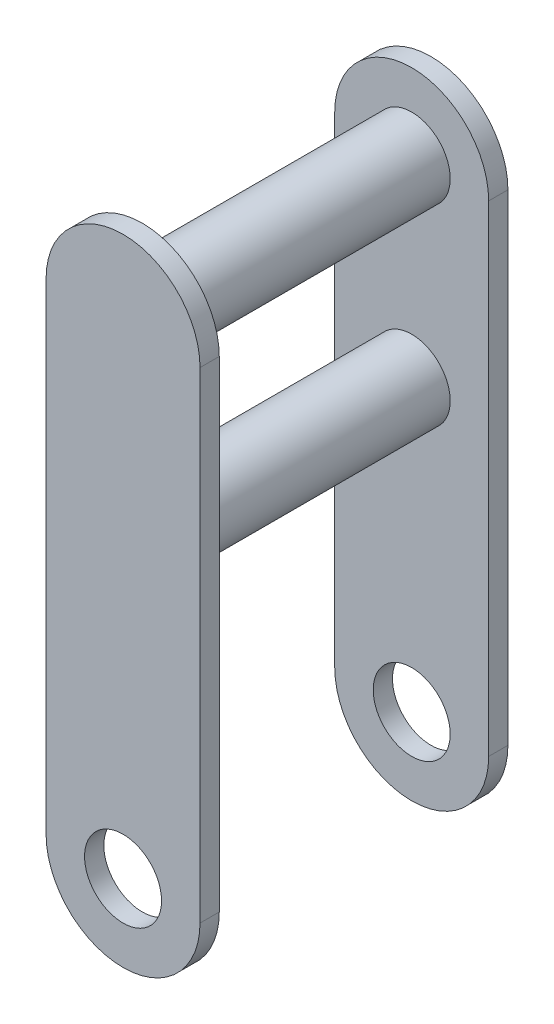
ISO-10303-21;
HEADER;
FILE_DESCRIPTION(('STEP AP214'),'2;1');
FILE_NAME('part.step','',(''),(''),'','','');
FILE_SCHEMA(('AUTOMOTIVE_DESIGN { 1 0 10303 214 1 1 1 1 }'));
ENDSEC;
DATA;
#1=APPLICATION_CONTEXT('core data for automotive mechanical design processes');
#2=APPLICATION_PROTOCOL_DEFINITION('international standard','automotive_design',2000,#1);
#3=PRODUCT_CONTEXT('',#1,'mechanical');
#4=PRODUCT('Part','Part','',(#3));
#5=PRODUCT_RELATED_PRODUCT_CATEGORY('part','',(#4));
#6=PRODUCT_DEFINITION_FORMATION('','',#4);
#7=PRODUCT_DEFINITION_CONTEXT('part definition',#1,'design');
#8=PRODUCT_DEFINITION('design','',#6,#7);
#9=PRODUCT_DEFINITION_SHAPE('','',#8);
#10=(LENGTH_UNIT() NAMED_UNIT(*) SI_UNIT(.MILLI.,.METRE.));
#11=(NAMED_UNIT(*) PLANE_ANGLE_UNIT() SI_UNIT($,.RADIAN.));
#12=(NAMED_UNIT(*) SI_UNIT($,.STERADIAN.) SOLID_ANGLE_UNIT());
#13=UNCERTAINTY_MEASURE_WITH_UNIT(LENGTH_MEASURE(1.E-05),#10,'distance_accuracy_value','');
#14=(GEOMETRIC_REPRESENTATION_CONTEXT(3) GLOBAL_UNCERTAINTY_ASSIGNED_CONTEXT((#13)) GLOBAL_UNIT_ASSIGNED_CONTEXT((#10,
#11,#12)) REPRESENTATION_CONTEXT('',''));
#15=CARTESIAN_POINT('',(0.,0.,0.));
#16=DIRECTION('',(0.,0.,1.));
#17=DIRECTION('',(1.,0.,0.));
#18=AXIS2_PLACEMENT_3D('',#15,#16,#17);
#19=CARTESIAN_POINT('',(0.,0.,80.));
#20=DIRECTION('',(0.,0.,1.));
#21=DIRECTION('',(1.,0.,0.));
#22=AXIS2_PLACEMENT_3D('',#19,#20,#21);
#23=PLANE('',#22);
#24=CARTESIAN_POINT('',(0.,0.,80.));
#25=DIRECTION('',(0.,0.,1.));
#26=DIRECTION('',(1.,0.,0.));
#27=AXIS2_PLACEMENT_3D('',#24,#25,#26);
#28=CIRCLE('',#27,40.);
#29=CARTESIAN_POINT('',(-40.,0.,80.));
#30=VERTEX_POINT('',#29);
#31=CARTESIAN_POINT('',(40.,0.,80.));
#32=VERTEX_POINT('',#31);
#33=EDGE_CURVE('E193',#30,#32,#28,.T.);
#34=ORIENTED_EDGE('',*,*,#33,.T.);
#35=DIRECTION('',(0.,1.,0.));
#36=VECTOR('',#35,1.);
#37=CARTESIAN_POINT('',(40.,0.,80.));
#38=LINE('',#37,#36);
#39=CARTESIAN_POINT('',(40.,250.,80.));
#40=VERTEX_POINT('',#39);
#41=EDGE_CURVE('E93',#32,#40,#38,.T.);
#42=ORIENTED_EDGE('',*,*,#41,.T.);
#43=CARTESIAN_POINT('',(0.,250.,80.));
#44=DIRECTION('',(0.,0.,1.));
#45=DIRECTION('',(1.,0.,0.));
#46=AXIS2_PLACEMENT_3D('',#43,#44,#45);
#47=CIRCLE('',#46,40.);
#48=CARTESIAN_POINT('',(-40.,250.,80.));
#49=VERTEX_POINT('',#48);
#50=EDGE_CURVE('E198',#40,#49,#47,.T.);
#51=ORIENTED_EDGE('',*,*,#50,.T.);
#52=DIRECTION('',(0.,-1.,0.));
#53=VECTOR('',#52,1.);
#54=CARTESIAN_POINT('',(-40.,0.,80.));
#55=LINE('',#54,#53);
#56=EDGE_CURVE('E61',#49,#30,#55,.T.);
#57=ORIENTED_EDGE('',*,*,#56,.T.);
#58=EDGE_LOOP('',(#34,#42,#51,#57));
#59=FACE_BOUND('',#58,.T.);
#60=CARTESIAN_POINT('',(0.,0.,80.));
#61=DIRECTION('',(0.,0.,1.));
#62=DIRECTION('',(1.,0.,0.));
#63=AXIS2_PLACEMENT_3D('',#60,#61,#62);
#64=CIRCLE('',#63,20.);
#65=CARTESIAN_POINT('',(20.,0.,80.));
#66=VERTEX_POINT('',#65);
#67=EDGE_CURVE('E185',#66,#66,#64,.T.);
#68=ORIENTED_EDGE('',*,*,#67,.F.);
#69=EDGE_LOOP('',(#68));
#70=FACE_BOUND('',#69,.T.);
#71=ADVANCED_FACE('F43',(#59,#70),#23,.T.);
#72=CARTESIAN_POINT('',(0.,0.,70.));
#73=DIRECTION('',(0.,0.,1.));
#74=DIRECTION('',(1.,0.,0.));
#75=AXIS2_PLACEMENT_3D('',#72,#73,#74);
#76=PLANE('',#75);
#77=CARTESIAN_POINT('',(0.,150.,70.));
#78=DIRECTION('',(0.,0.,1.));
#79=DIRECTION('',(1.,0.,0.));
#80=AXIS2_PLACEMENT_3D('',#77,#78,#79);
#81=CIRCLE('',#80,20.);
#82=CARTESIAN_POINT('',(20.,150.,70.));
#83=VERTEX_POINT('',#82);
#84=EDGE_CURVE('E11',#83,#83,#81,.F.);
#85=ORIENTED_EDGE('',*,*,#84,.F.);
#86=EDGE_LOOP('',(#85));
#87=FACE_BOUND('',#86,.T.);
#88=CARTESIAN_POINT('',(0.,250.,70.));
#89=DIRECTION('',(0.,0.,1.));
#90=DIRECTION('',(1.,0.,0.));
#91=AXIS2_PLACEMENT_3D('',#88,#89,#90);
#92=CIRCLE('',#91,20.);
#93=CARTESIAN_POINT('',(20.,250.,70.));
#94=VERTEX_POINT('',#93);
#95=EDGE_CURVE('E53',#94,#94,#92,.F.);
#96=ORIENTED_EDGE('',*,*,#95,.F.);
#97=EDGE_LOOP('',(#96));
#98=FACE_BOUND('',#97,.T.);
#99=CARTESIAN_POINT('',(0.,0.,70.));
#100=DIRECTION('',(0.,0.,1.));
#101=DIRECTION('',(1.,0.,0.));
#102=AXIS2_PLACEMENT_3D('',#99,#100,#101);
#103=CIRCLE('',#102,40.);
#104=CARTESIAN_POINT('',(-40.,0.,70.));
#105=VERTEX_POINT('',#104);
#106=CARTESIAN_POINT('',(40.,0.,70.));
#107=VERTEX_POINT('',#106);
#108=EDGE_CURVE('E189',#105,#107,#103,.T.);
#109=ORIENTED_EDGE('',*,*,#108,.F.);
#110=DIRECTION('',(0.,-1.,0.));
#111=VECTOR('',#110,1.);
#112=CARTESIAN_POINT('',(-40.,0.,70.));
#113=LINE('',#112,#111);
#114=CARTESIAN_POINT('',(-40.,250.,70.));
#115=VERTEX_POINT('',#114);
#116=EDGE_CURVE('E85',#115,#105,#113,.T.);
#117=ORIENTED_EDGE('',*,*,#116,.F.);
#118=CARTESIAN_POINT('',(0.,250.,70.));
#119=DIRECTION('',(0.,0.,1.));
#120=DIRECTION('',(1.,0.,0.));
#121=AXIS2_PLACEMENT_3D('',#118,#119,#120);
#122=CIRCLE('',#121,40.);
#123=CARTESIAN_POINT('',(40.,250.,70.));
#124=VERTEX_POINT('',#123);
#125=EDGE_CURVE('E79',#124,#115,#122,.T.);
#126=ORIENTED_EDGE('',*,*,#125,.F.);
#127=DIRECTION('',(0.,1.,0.));
#128=VECTOR('',#127,1.);
#129=CARTESIAN_POINT('',(40.,0.,70.));
#130=LINE('',#129,#128);
#131=EDGE_CURVE('E207',#107,#124,#130,.T.);
#132=ORIENTED_EDGE('',*,*,#131,.F.);
#133=EDGE_LOOP('',(#109,#117,#126,#132));
#134=FACE_BOUND('',#133,.T.);
#135=CARTESIAN_POINT('',(0.,0.,70.));
#136=DIRECTION('',(0.,0.,1.));
#137=DIRECTION('',(1.,0.,0.));
#138=AXIS2_PLACEMENT_3D('',#135,#136,#137);
#139=CIRCLE('',#138,20.);
#140=CARTESIAN_POINT('',(20.,0.,70.));
#141=VERTEX_POINT('',#140);
#142=EDGE_CURVE('E184',#141,#141,#139,.T.);
#143=ORIENTED_EDGE('',*,*,#142,.T.);
#144=EDGE_LOOP('',(#143));
#145=FACE_BOUND('',#144,.T.);
#146=ADVANCED_FACE('F230',(#87,#98,#134,#145),#76,.F.);
#147=CARTESIAN_POINT('',(0.,0.,80.));
#148=DIRECTION('',(0.,0.,-1.));
#149=DIRECTION('',(-1.,0.,0.));
#150=AXIS2_PLACEMENT_3D('',#147,#148,#149);
#151=CYLINDRICAL_SURFACE('',#150,40.);
#152=ORIENTED_EDGE('',*,*,#108,.T.);
#153=DIRECTION('',(0.,0.,-1.));
#154=VECTOR('',#153,1.);
#155=CARTESIAN_POINT('',(40.,0.,80.));
#156=LINE('',#155,#154);
#157=EDGE_CURVE('E222',#32,#107,#156,.T.);
#158=ORIENTED_EDGE('',*,*,#157,.F.);
#159=ORIENTED_EDGE('',*,*,#33,.F.);
#160=DIRECTION('',(0.,0.,-1.));
#161=VECTOR('',#160,1.);
#162=CARTESIAN_POINT('',(-40.,0.,80.));
#163=LINE('',#162,#161);
#164=EDGE_CURVE('E203',#30,#105,#163,.T.);
#165=ORIENTED_EDGE('',*,*,#164,.T.);
#166=EDGE_LOOP('',(#152,#158,#159,#165));
#167=FACE_BOUND('',#166,.T.);
#168=ADVANCED_FACE('F45',(#167),#151,.T.);
#169=CARTESIAN_POINT('',(40.,0.,80.));
#170=DIRECTION('',(-1.,0.,0.));
#171=DIRECTION('',(0.,0.,1.));
#172=AXIS2_PLACEMENT_3D('',#169,#170,#171);
#173=PLANE('',#172);
#174=ORIENTED_EDGE('',*,*,#131,.T.);
#175=DIRECTION('',(0.,0.,-1.));
#176=VECTOR('',#175,1.);
#177=CARTESIAN_POINT('',(40.,250.,80.));
#178=LINE('',#177,#176);
#179=EDGE_CURVE('E219',#40,#124,#178,.T.);
#180=ORIENTED_EDGE('',*,*,#179,.F.);
#181=ORIENTED_EDGE('',*,*,#41,.F.);
#182=ORIENTED_EDGE('',*,*,#157,.T.);
#183=EDGE_LOOP('',(#174,#180,#181,#182));
#184=FACE_BOUND('',#183,.T.);
#185=ADVANCED_FACE('F260',(#184),#173,.F.);
#186=CARTESIAN_POINT('',(0.,250.,80.));
#187=DIRECTION('',(0.,0.,-1.));
#188=DIRECTION('',(-1.,0.,0.));
#189=AXIS2_PLACEMENT_3D('',#186,#187,#188);
#190=CYLINDRICAL_SURFACE('',#189,40.);
#191=ORIENTED_EDGE('',*,*,#125,.T.);
#192=DIRECTION('',(0.,0.,-1.));
#193=VECTOR('',#192,1.);
#194=CARTESIAN_POINT('',(-40.,250.,80.));
#195=LINE('',#194,#193);
#196=EDGE_CURVE('E216',#49,#115,#195,.T.);
#197=ORIENTED_EDGE('',*,*,#196,.F.);
#198=ORIENTED_EDGE('',*,*,#50,.F.);
#199=ORIENTED_EDGE('',*,*,#179,.T.);
#200=EDGE_LOOP('',(#191,#197,#198,#199));
#201=FACE_BOUND('',#200,.T.);
#202=ADVANCED_FACE('F251',(#201),#190,.T.);
#203=CARTESIAN_POINT('',(-40.,0.,80.));
#204=DIRECTION('',(1.,0.,0.));
#205=DIRECTION('',(0.,0.,-1.));
#206=AXIS2_PLACEMENT_3D('',#203,#204,#205);
#207=PLANE('',#206);
#208=ORIENTED_EDGE('',*,*,#116,.T.);
#209=ORIENTED_EDGE('',*,*,#164,.F.);
#210=ORIENTED_EDGE('',*,*,#56,.F.);
#211=ORIENTED_EDGE('',*,*,#196,.T.);
#212=EDGE_LOOP('',(#208,#209,#210,#211));
#213=FACE_BOUND('',#212,.T.);
#214=ADVANCED_FACE('F241',(#213),#207,.F.);
#215=CARTESIAN_POINT('',(0.,0.,80.));
#216=DIRECTION('',(0.,0.,-1.));
#217=DIRECTION('',(-1.,0.,0.));
#218=AXIS2_PLACEMENT_3D('',#215,#216,#217);
#219=CYLINDRICAL_SURFACE('',#218,20.);
#220=ORIENTED_EDGE('',*,*,#67,.T.);
#221=EDGE_LOOP('',(#220));
#222=FACE_BOUND('',#221,.T.);
#223=ORIENTED_EDGE('',*,*,#142,.F.);
#224=EDGE_LOOP('',(#223));
#225=FACE_BOUND('',#224,.T.);
#226=ADVANCED_FACE('F239',(#222,#225),#219,.F.);
#227=CARTESIAN_POINT('',(0.,250.,-70.));
#228=DIRECTION('',(0.,0.,1.));
#229=DIRECTION('',(1.,0.,0.));
#230=AXIS2_PLACEMENT_3D('',#227,#228,#229);
#231=CYLINDRICAL_SURFACE('',#230,20.);
#232=CARTESIAN_POINT('',(0.,250.,-70.));
#233=DIRECTION('',(0.,0.,-1.));
#234=DIRECTION('',(-1.,0.,0.));
#235=AXIS2_PLACEMENT_3D('',#232,#233,#234);
#236=CIRCLE('',#235,20.);
#237=CARTESIAN_POINT('',(-20.,250.,-70.));
#238=VERTEX_POINT('',#237);
#239=EDGE_CURVE('E180',#238,#238,#236,.T.);
#240=ORIENTED_EDGE('',*,*,#239,.F.);
#241=EDGE_LOOP('',(#240));
#242=FACE_BOUND('',#241,.T.);
#243=ORIENTED_EDGE('',*,*,#95,.T.);
#244=EDGE_LOOP('',(#243));
#245=FACE_BOUND('',#244,.T.);
#246=ADVANCED_FACE('F228',(#242,#245),#231,.T.);
#247=CARTESIAN_POINT('',(0.,150.,-70.));
#248=DIRECTION('',(0.,0.,1.));
#249=DIRECTION('',(1.,0.,0.));
#250=AXIS2_PLACEMENT_3D('',#247,#248,#249);
#251=CYLINDRICAL_SURFACE('',#250,20.);
#252=CARTESIAN_POINT('',(0.,150.,-70.));
#253=DIRECTION('',(0.,0.,-1.));
#254=DIRECTION('',(-1.,0.,0.));
#255=AXIS2_PLACEMENT_3D('',#252,#253,#254);
#256=CIRCLE('',#255,20.);
#257=CARTESIAN_POINT('',(-20.,150.,-70.));
#258=VERTEX_POINT('',#257);
#259=EDGE_CURVE('E132',#258,#258,#256,.T.);
#260=ORIENTED_EDGE('',*,*,#259,.F.);
#261=EDGE_LOOP('',(#260));
#262=FACE_BOUND('',#261,.T.);
#263=ORIENTED_EDGE('',*,*,#84,.T.);
#264=EDGE_LOOP('',(#263));
#265=FACE_BOUND('',#264,.T.);
#266=ADVANCED_FACE('F248',(#262,#265),#251,.T.);
#267=CARTESIAN_POINT('',(0.,0.,-80.));
#268=DIRECTION('',(0.,0.,1.));
#269=DIRECTION('',(1.,0.,0.));
#270=AXIS2_PLACEMENT_3D('',#267,#268,#269);
#271=CYLINDRICAL_SURFACE('',#270,40.);
#272=CARTESIAN_POINT('',(0.,0.,-70.));
#273=DIRECTION('',(0.,0.,1.));
#274=DIRECTION('',(1.,0.,0.));
#275=AXIS2_PLACEMENT_3D('',#272,#273,#274);
#276=CIRCLE('',#275,40.);
#277=CARTESIAN_POINT('',(-40.,0.,-70.));
#278=VERTEX_POINT('',#277);
#279=CARTESIAN_POINT('',(40.,0.,-70.));
#280=VERTEX_POINT('',#279);
#281=EDGE_CURVE('E126',#278,#280,#276,.T.);
#282=ORIENTED_EDGE('',*,*,#281,.F.);
#283=DIRECTION('',(0.,0.,1.));
#284=VECTOR('',#283,1.);
#285=CARTESIAN_POINT('',(-40.,0.,-80.));
#286=LINE('',#285,#284);
#287=CARTESIAN_POINT('',(-40.,0.,-80.));
#288=VERTEX_POINT('',#287);
#289=EDGE_CURVE('E120',#288,#278,#286,.T.);
#290=ORIENTED_EDGE('',*,*,#289,.F.);
#291=CARTESIAN_POINT('',(0.,0.,-80.));
#292=DIRECTION('',(0.,0.,1.));
#293=DIRECTION('',(1.,0.,0.));
#294=AXIS2_PLACEMENT_3D('',#291,#292,#293);
#295=CIRCLE('',#294,40.);
#296=CARTESIAN_POINT('',(40.,0.,-80.));
#297=VERTEX_POINT('',#296);
#298=EDGE_CURVE('E123',#288,#297,#295,.T.);
#299=ORIENTED_EDGE('',*,*,#298,.T.);
#300=DIRECTION('',(0.,0.,1.));
#301=VECTOR('',#300,1.);
#302=CARTESIAN_POINT('',(40.,0.,-80.));
#303=LINE('',#302,#301);
#304=EDGE_CURVE('E156',#297,#280,#303,.T.);
#305=ORIENTED_EDGE('',*,*,#304,.T.);
#306=EDGE_LOOP('',(#282,#290,#299,#305));
#307=FACE_BOUND('',#306,.T.);
#308=ADVANCED_FACE('F122',(#307),#271,.T.);
#309=CARTESIAN_POINT('',(-40.,0.,-80.));
#310=DIRECTION('',(-1.,0.,0.));
#311=DIRECTION('',(0.,0.,1.));
#312=AXIS2_PLACEMENT_3D('',#309,#310,#311);
#313=PLANE('',#312);
#314=DIRECTION('',(0.,-1.,0.));
#315=VECTOR('',#314,1.);
#316=CARTESIAN_POINT('',(-40.,0.,-70.));
#317=LINE('',#316,#315);
#318=CARTESIAN_POINT('',(-40.,250.,-70.));
#319=VERTEX_POINT('',#318);
#320=EDGE_CURVE('E159',#319,#278,#317,.T.);
#321=ORIENTED_EDGE('',*,*,#320,.F.);
#322=DIRECTION('',(0.,0.,1.));
#323=VECTOR('',#322,1.);
#324=CARTESIAN_POINT('',(-40.,250.,-80.));
#325=LINE('',#324,#323);
#326=CARTESIAN_POINT('',(-40.,250.,-80.));
#327=VERTEX_POINT('',#326);
#328=EDGE_CURVE('E133',#327,#319,#325,.T.);
#329=ORIENTED_EDGE('',*,*,#328,.F.);
#330=DIRECTION('',(0.,-1.,0.));
#331=VECTOR('',#330,1.);
#332=CARTESIAN_POINT('',(-40.,0.,-80.));
#333=LINE('',#332,#331);
#334=EDGE_CURVE('E139',#327,#288,#333,.T.);
#335=ORIENTED_EDGE('',*,*,#334,.T.);
#336=ORIENTED_EDGE('',*,*,#289,.T.);
#337=EDGE_LOOP('',(#321,#329,#335,#336));
#338=FACE_BOUND('',#337,.T.);
#339=ADVANCED_FACE('F146',(#338),#313,.T.);
#340=CARTESIAN_POINT('',(0.,250.,-80.));
#341=DIRECTION('',(0.,0.,1.));
#342=DIRECTION('',(1.,0.,0.));
#343=AXIS2_PLACEMENT_3D('',#340,#341,#342);
#344=CYLINDRICAL_SURFACE('',#343,40.);
#345=CARTESIAN_POINT('',(0.,250.,-70.));
#346=DIRECTION('',(0.,0.,1.));
#347=DIRECTION('',(1.,0.,0.));
#348=AXIS2_PLACEMENT_3D('',#345,#346,#347);
#349=CIRCLE('',#348,40.);
#350=CARTESIAN_POINT('',(40.,250.,-70.));
#351=VERTEX_POINT('',#350);
#352=EDGE_CURVE('E163',#351,#319,#349,.T.);
#353=ORIENTED_EDGE('',*,*,#352,.F.);
#354=DIRECTION('',(0.,0.,1.));
#355=VECTOR('',#354,1.);
#356=CARTESIAN_POINT('',(40.,250.,-80.));
#357=LINE('',#356,#355);
#358=CARTESIAN_POINT('',(40.,250.,-80.));
#359=VERTEX_POINT('',#358);
#360=EDGE_CURVE('E172',#359,#351,#357,.T.);
#361=ORIENTED_EDGE('',*,*,#360,.F.);
#362=CARTESIAN_POINT('',(0.,250.,-80.));
#363=DIRECTION('',(0.,0.,1.));
#364=DIRECTION('',(1.,0.,0.));
#365=AXIS2_PLACEMENT_3D('',#362,#363,#364);
#366=CIRCLE('',#365,40.);
#367=EDGE_CURVE('E148',#359,#327,#366,.T.);
#368=ORIENTED_EDGE('',*,*,#367,.T.);
#369=ORIENTED_EDGE('',*,*,#328,.T.);
#370=EDGE_LOOP('',(#353,#361,#368,#369));
#371=FACE_BOUND('',#370,.T.);
#372=ADVANCED_FACE('F315',(#371),#344,.T.);
#373=CARTESIAN_POINT('',(40.,0.,-80.));
#374=DIRECTION('',(1.,0.,0.));
#375=DIRECTION('',(0.,0.,-1.));
#376=AXIS2_PLACEMENT_3D('',#373,#374,#375);
#377=PLANE('',#376);
#378=DIRECTION('',(0.,1.,0.));
#379=VECTOR('',#378,1.);
#380=CARTESIAN_POINT('',(40.,0.,-70.));
#381=LINE('',#380,#379);
#382=EDGE_CURVE('E144',#280,#351,#381,.T.);
#383=ORIENTED_EDGE('',*,*,#382,.F.);
#384=ORIENTED_EDGE('',*,*,#304,.F.);
#385=DIRECTION('',(0.,1.,0.));
#386=VECTOR('',#385,1.);
#387=CARTESIAN_POINT('',(40.,0.,-80.));
#388=LINE('',#387,#386);
#389=EDGE_CURVE('E142',#297,#359,#388,.T.);
#390=ORIENTED_EDGE('',*,*,#389,.T.);
#391=ORIENTED_EDGE('',*,*,#360,.T.);
#392=EDGE_LOOP('',(#383,#384,#390,#391));
#393=FACE_BOUND('',#392,.T.);
#394=ADVANCED_FACE('F325',(#393),#377,.T.);
#395=CARTESIAN_POINT('',(0.,0.,-80.));
#396=DIRECTION('',(0.,0.,-1.));
#397=DIRECTION('',(1.,0.,0.));
#398=AXIS2_PLACEMENT_3D('',#395,#396,#397);
#399=PLANE('',#398);
#400=CARTESIAN_POINT('',(0.,0.,-80.));
#401=DIRECTION('',(0.,0.,1.));
#402=DIRECTION('',(1.,0.,0.));
#403=AXIS2_PLACEMENT_3D('',#400,#401,#402);
#404=CIRCLE('',#403,20.);
#405=CARTESIAN_POINT('',(20.,0.,-80.));
#406=VERTEX_POINT('',#405);
#407=EDGE_CURVE('E160',#406,#406,#404,.T.);
#408=ORIENTED_EDGE('',*,*,#407,.T.);
#409=EDGE_LOOP('',(#408));
#410=FACE_BOUND('',#409,.T.);
#411=ORIENTED_EDGE('',*,*,#298,.F.);
#412=ORIENTED_EDGE('',*,*,#334,.F.);
#413=ORIENTED_EDGE('',*,*,#367,.F.);
#414=ORIENTED_EDGE('',*,*,#389,.F.);
#415=EDGE_LOOP('',(#411,#412,#413,#414));
#416=FACE_BOUND('',#415,.T.);
#417=ADVANCED_FACE('F137',(#410,#416),#399,.T.);
#418=CARTESIAN_POINT('',(0.,0.,-70.));
#419=DIRECTION('',(0.,0.,-1.));
#420=DIRECTION('',(1.,0.,0.));
#421=AXIS2_PLACEMENT_3D('',#418,#419,#420);
#422=PLANE('',#421);
#423=ORIENTED_EDGE('',*,*,#239,.T.);
#424=EDGE_LOOP('',(#423));
#425=FACE_BOUND('',#424,.T.);
#426=ORIENTED_EDGE('',*,*,#259,.T.);
#427=EDGE_LOOP('',(#426));
#428=FACE_BOUND('',#427,.T.);
#429=CARTESIAN_POINT('',(0.,0.,-70.));
#430=DIRECTION('',(0.,0.,1.));
#431=DIRECTION('',(1.,0.,0.));
#432=AXIS2_PLACEMENT_3D('',#429,#430,#431);
#433=CIRCLE('',#432,20.);
#434=CARTESIAN_POINT('',(20.,0.,-70.));
#435=VERTEX_POINT('',#434);
#436=EDGE_CURVE('E422',#435,#435,#433,.T.);
#437=ORIENTED_EDGE('',*,*,#436,.F.);
#438=EDGE_LOOP('',(#437));
#439=FACE_BOUND('',#438,.T.);
#440=ORIENTED_EDGE('',*,*,#281,.T.);
#441=ORIENTED_EDGE('',*,*,#382,.T.);
#442=ORIENTED_EDGE('',*,*,#352,.T.);
#443=ORIENTED_EDGE('',*,*,#320,.T.);
#444=EDGE_LOOP('',(#440,#441,#442,#443));
#445=FACE_BOUND('',#444,.T.);
#446=ADVANCED_FACE('F346',(#425,#428,#439,#445),#422,.F.);
#447=CARTESIAN_POINT('',(0.,0.,-80.));
#448=DIRECTION('',(0.,0.,1.));
#449=DIRECTION('',(1.,0.,0.));
#450=AXIS2_PLACEMENT_3D('',#447,#448,#449);
#451=CYLINDRICAL_SURFACE('',#450,20.);
#452=ORIENTED_EDGE('',*,*,#407,.F.);
#453=EDGE_LOOP('',(#452));
#454=FACE_BOUND('',#453,.T.);
#455=ORIENTED_EDGE('',*,*,#436,.T.);
#456=EDGE_LOOP('',(#455));
#457=FACE_BOUND('',#456,.T.);
#458=ADVANCED_FACE('F357',(#454,#457),#451,.F.);
#459=CLOSED_SHELL('',(#71,#146,#168,#185,#202,#214,#226,#246,#266,#308,#339,#372,#394,#417,#446,#458));
#460=MANIFOLD_SOLID_BREP('B2',#459);
#461=ADVANCED_BREP_SHAPE_REPRESENTATION('',(#18,#460),#14);
#462=SHAPE_DEFINITION_REPRESENTATION(#9,#461);
ENDSEC;
END-ISO-10303-21;
